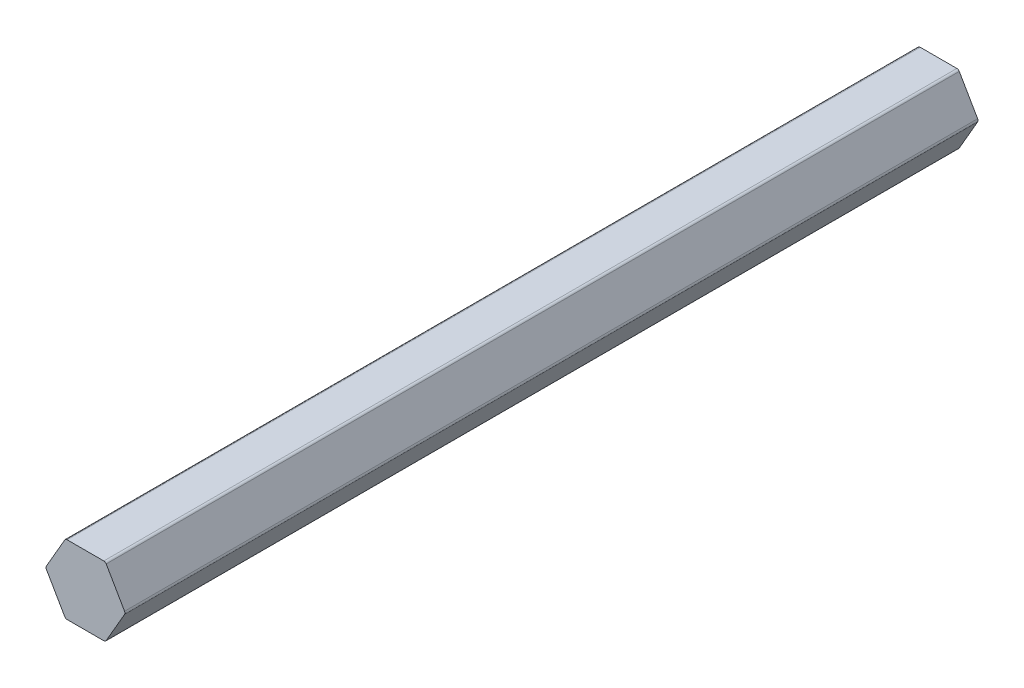
ISO-10303-21;
HEADER;
FILE_DESCRIPTION(('STEP AP214'),'2;1');
FILE_NAME('part.step','',(''),(''),'','','');
FILE_SCHEMA(('AUTOMOTIVE_DESIGN { 1 0 10303 214 1 1 1 1 }'));
ENDSEC;
DATA;
#1=APPLICATION_CONTEXT('core data for automotive mechanical design processes');
#2=APPLICATION_PROTOCOL_DEFINITION('international standard','automotive_design',2000,#1);
#3=PRODUCT_CONTEXT('',#1,'mechanical');
#4=PRODUCT('Part','Part','',(#3));
#5=PRODUCT_RELATED_PRODUCT_CATEGORY('part','',(#4));
#6=PRODUCT_DEFINITION_FORMATION('','',#4);
#7=PRODUCT_DEFINITION_CONTEXT('part definition',#1,'design');
#8=PRODUCT_DEFINITION('design','',#6,#7);
#9=PRODUCT_DEFINITION_SHAPE('','',#8);
#10=(LENGTH_UNIT() NAMED_UNIT(*) SI_UNIT(.MILLI.,.METRE.));
#11=(NAMED_UNIT(*) PLANE_ANGLE_UNIT() SI_UNIT($,.RADIAN.));
#12=(NAMED_UNIT(*) SI_UNIT($,.STERADIAN.) SOLID_ANGLE_UNIT());
#13=UNCERTAINTY_MEASURE_WITH_UNIT(LENGTH_MEASURE(1.E-05),#10,'distance_accuracy_value','');
#14=(GEOMETRIC_REPRESENTATION_CONTEXT(3) GLOBAL_UNCERTAINTY_ASSIGNED_CONTEXT((#13)) GLOBAL_UNIT_ASSIGNED_CONTEXT((#10,
#11,#12)) REPRESENTATION_CONTEXT('',''));
#15=CARTESIAN_POINT('',(0.,0.,0.));
#16=DIRECTION('',(0.,0.,1.));
#17=DIRECTION('',(1.,0.,0.));
#18=AXIS2_PLACEMENT_3D('',#15,#16,#17);
#19=CARTESIAN_POINT('',(-3.36554792418708,-5.8293,-72.136));
#20=DIRECTION('',(0.,0.,-1.));
#21=DIRECTION('',(-1.,0.,0.));
#22=AXIS2_PLACEMENT_3D('',#19,#20,#21);
#23=CYLINDRICAL_SURFACE('',#22,0.507999999999999);
#24=CARTESIAN_POINT('',(-3.36554792418708,-5.8293,-228.6));
#25=DIRECTION('',(0.,0.,-1.));
#26=DIRECTION('',(-1.,0.,0.));
#27=AXIS2_PLACEMENT_3D('',#24,#25,#26);
#28=CIRCLE('',#27,0.507999999999999);
#29=CARTESIAN_POINT('',(-3.36554792418708,-6.3373,-228.6));
#30=VERTEX_POINT('',#29);
#31=CARTESIAN_POINT('',(-3.80548882930957,-6.0833,-228.6));
#32=VERTEX_POINT('',#31);
#33=EDGE_CURVE('E153',#30,#32,#28,.T.);
#34=ORIENTED_EDGE('',*,*,#33,.F.);
#35=DIRECTION('',(0.,0.,-1.));
#36=VECTOR('',#35,1.);
#37=CARTESIAN_POINT('',(-3.36554792418708,-6.3373,-72.136));
#38=LINE('',#37,#36);
#39=CARTESIAN_POINT('',(-3.36554792418708,-6.3373,-72.136));
#40=VERTEX_POINT('',#39);
#41=EDGE_CURVE('E11',#40,#30,#38,.T.);
#42=ORIENTED_EDGE('',*,*,#41,.F.);
#43=CARTESIAN_POINT('',(-3.36554792418708,-5.8293,-72.136));
#44=DIRECTION('',(0.,0.,-1.));
#45=DIRECTION('',(-1.,0.,0.));
#46=AXIS2_PLACEMENT_3D('',#43,#44,#45);
#47=CIRCLE('',#46,0.507999999999999);
#48=CARTESIAN_POINT('',(-3.80548882930957,-6.0833,-72.136));
#49=VERTEX_POINT('',#48);
#50=EDGE_CURVE('E185',#40,#49,#47,.T.);
#51=ORIENTED_EDGE('',*,*,#50,.T.);
#52=DIRECTION('',(0.,0.,-1.));
#53=VECTOR('',#52,1.);
#54=CARTESIAN_POINT('',(-3.80548882930957,-6.0833,-72.136));
#55=LINE('',#54,#53);
#56=EDGE_CURVE('E35',#49,#32,#55,.T.);
#57=ORIENTED_EDGE('',*,*,#56,.T.);
#58=EDGE_LOOP('',(#34,#42,#51,#57));
#59=FACE_BOUND('',#58,.T.);
#60=ADVANCED_FACE('F32',(#59),#23,.T.);
#61=CARTESIAN_POINT('',(3.36554792418708,-6.3373,-72.136));
#62=DIRECTION('',(0.,-1.,0.));
#63=DIRECTION('',(1.,0.,0.));
#64=AXIS2_PLACEMENT_3D('',#61,#62,#63);
#65=PLANE('',#64);
#66=DIRECTION('',(-1.,0.,0.));
#67=VECTOR('',#66,1.);
#68=CARTESIAN_POINT('',(3.36554792418708,-6.3373,-228.6));
#69=LINE('',#68,#67);
#70=CARTESIAN_POINT('',(3.36554792418708,-6.3373,-228.6));
#71=VERTEX_POINT('',#70);
#72=EDGE_CURVE('E183',#71,#30,#69,.T.);
#73=ORIENTED_EDGE('',*,*,#72,.F.);
#74=DIRECTION('',(0.,0.,-1.));
#75=VECTOR('',#74,1.);
#76=CARTESIAN_POINT('',(3.36554792418708,-6.3373,-72.136));
#77=LINE('',#76,#75);
#78=CARTESIAN_POINT('',(3.36554792418708,-6.3373,-72.136));
#79=VERTEX_POINT('',#78);
#80=EDGE_CURVE('E41',#79,#71,#77,.T.);
#81=ORIENTED_EDGE('',*,*,#80,.F.);
#82=DIRECTION('',(-1.,0.,0.));
#83=VECTOR('',#82,1.);
#84=CARTESIAN_POINT('',(3.36554792418708,-6.3373,-72.136));
#85=LINE('',#84,#83);
#86=EDGE_CURVE('E143',#79,#40,#85,.T.);
#87=ORIENTED_EDGE('',*,*,#86,.T.);
#88=ORIENTED_EDGE('',*,*,#41,.T.);
#89=EDGE_LOOP('',(#73,#81,#87,#88));
#90=FACE_BOUND('',#89,.T.);
#91=ADVANCED_FACE('F205',(#90),#65,.T.);
#92=CARTESIAN_POINT('',(3.36554792418709,-5.8293,-72.136));
#93=DIRECTION('',(0.,0.,-1.));
#94=DIRECTION('',(-1.,0.,0.));
#95=AXIS2_PLACEMENT_3D('',#92,#93,#94);
#96=CYLINDRICAL_SURFACE('',#95,0.508);
#97=CARTESIAN_POINT('',(3.36554792418709,-5.8293,-228.6));
#98=DIRECTION('',(0.,0.,-1.));
#99=DIRECTION('',(-1.,0.,0.));
#100=AXIS2_PLACEMENT_3D('',#97,#98,#99);
#101=CIRCLE('',#100,0.508);
#102=CARTESIAN_POINT('',(3.80548882930958,-6.0833,-228.6));
#103=VERTEX_POINT('',#102);
#104=EDGE_CURVE('E130',#103,#71,#101,.T.);
#105=ORIENTED_EDGE('',*,*,#104,.F.);
#106=DIRECTION('',(0.,0.,-1.));
#107=VECTOR('',#106,1.);
#108=CARTESIAN_POINT('',(3.80548882930958,-6.0833,-72.136));
#109=LINE('',#108,#107);
#110=CARTESIAN_POINT('',(3.80548882930958,-6.0833,-72.136));
#111=VERTEX_POINT('',#110);
#112=EDGE_CURVE('E125',#111,#103,#109,.T.);
#113=ORIENTED_EDGE('',*,*,#112,.F.);
#114=CARTESIAN_POINT('',(3.36554792418709,-5.8293,-72.136));
#115=DIRECTION('',(0.,0.,-1.));
#116=DIRECTION('',(-1.,0.,0.));
#117=AXIS2_PLACEMENT_3D('',#114,#115,#116);
#118=CIRCLE('',#117,0.508);
#119=EDGE_CURVE('E128',#111,#79,#118,.T.);
#120=ORIENTED_EDGE('',*,*,#119,.T.);
#121=ORIENTED_EDGE('',*,*,#80,.T.);
#122=EDGE_LOOP('',(#105,#113,#120,#121));
#123=FACE_BOUND('',#122,.T.);
#124=ADVANCED_FACE('F127',(#123),#96,.T.);
#125=CARTESIAN_POINT('',(7.17103675349666,-0.253999999999997,-72.136));
#126=DIRECTION('',(0.866025403784439,-0.499999999999999,0.));
#127=DIRECTION('',(0.499999999999999,0.866025403784439,0.));
#128=AXIS2_PLACEMENT_3D('',#125,#126,#127);
#129=PLANE('',#128);
#130=DIRECTION('',(-0.499999999999999,-0.866025403784439,0.));
#131=VECTOR('',#130,1.);
#132=CARTESIAN_POINT('',(7.17103675349666,-0.253999999999997,-228.6));
#133=LINE('',#132,#131);
#134=CARTESIAN_POINT('',(7.17103675349666,-0.253999999999997,-228.6));
#135=VERTEX_POINT('',#134);
#136=EDGE_CURVE('E180',#135,#103,#133,.T.);
#137=ORIENTED_EDGE('',*,*,#136,.F.);
#138=DIRECTION('',(0.,0.,-1.));
#139=VECTOR('',#138,1.);
#140=CARTESIAN_POINT('',(7.17103675349666,-0.253999999999997,-72.136));
#141=LINE('',#140,#139);
#142=CARTESIAN_POINT('',(7.17103675349666,-0.253999999999997,-72.136));
#143=VERTEX_POINT('',#142);
#144=EDGE_CURVE('E135',#143,#135,#141,.T.);
#145=ORIENTED_EDGE('',*,*,#144,.F.);
#146=DIRECTION('',(-0.499999999999999,-0.866025403784439,0.));
#147=VECTOR('',#146,1.);
#148=CARTESIAN_POINT('',(7.17103675349666,-0.253999999999997,-72.136));
#149=LINE('',#148,#147);
#150=EDGE_CURVE('E141',#143,#111,#149,.T.);
#151=ORIENTED_EDGE('',*,*,#150,.T.);
#152=ORIENTED_EDGE('',*,*,#112,.T.);
#153=EDGE_LOOP('',(#137,#145,#151,#152));
#154=FACE_BOUND('',#153,.T.);
#155=ADVANCED_FACE('F145',(#154),#129,.T.);
#156=CARTESIAN_POINT('',(6.73109584837417,0.,-72.136));
#157=DIRECTION('',(0.,0.,-1.));
#158=DIRECTION('',(-1.,0.,0.));
#159=AXIS2_PLACEMENT_3D('',#156,#157,#158);
#160=CYLINDRICAL_SURFACE('',#159,0.507999999999999);
#161=CARTESIAN_POINT('',(6.73109584837417,0.,-228.6));
#162=DIRECTION('',(0.,0.,-1.));
#163=DIRECTION('',(-1.,0.,0.));
#164=AXIS2_PLACEMENT_3D('',#161,#162,#163);
#165=CIRCLE('',#164,0.507999999999999);
#166=CARTESIAN_POINT('',(7.17103675349666,0.254000000000003,-228.6));
#167=VERTEX_POINT('',#166);
#168=EDGE_CURVE('E177',#167,#135,#165,.T.);
#169=ORIENTED_EDGE('',*,*,#168,.F.);
#170=DIRECTION('',(0.,0.,-1.));
#171=VECTOR('',#170,1.);
#172=CARTESIAN_POINT('',(7.17103675349666,0.254000000000003,-72.136));
#173=LINE('',#172,#171);
#174=CARTESIAN_POINT('',(7.17103675349666,0.254000000000003,-72.136));
#175=VERTEX_POINT('',#174);
#176=EDGE_CURVE('E189',#175,#167,#173,.T.);
#177=ORIENTED_EDGE('',*,*,#176,.F.);
#178=CARTESIAN_POINT('',(6.73109584837417,0.,-72.136));
#179=DIRECTION('',(0.,0.,-1.));
#180=DIRECTION('',(-1.,0.,0.));
#181=AXIS2_PLACEMENT_3D('',#178,#179,#180);
#182=CIRCLE('',#181,0.507999999999999);
#183=EDGE_CURVE('E146',#175,#143,#182,.T.);
#184=ORIENTED_EDGE('',*,*,#183,.T.);
#185=ORIENTED_EDGE('',*,*,#144,.T.);
#186=EDGE_LOOP('',(#169,#177,#184,#185));
#187=FACE_BOUND('',#186,.T.);
#188=ADVANCED_FACE('F218',(#187),#160,.T.);
#189=CARTESIAN_POINT('',(3.80548882930958,6.0833,-72.136));
#190=DIRECTION('',(0.866025403784439,0.5,0.));
#191=DIRECTION('',(-0.5,0.866025403784439,0.));
#192=AXIS2_PLACEMENT_3D('',#189,#190,#191);
#193=PLANE('',#192);
#194=DIRECTION('',(0.5,-0.866025403784439,0.));
#195=VECTOR('',#194,1.);
#196=CARTESIAN_POINT('',(3.80548882930958,6.0833,-228.6));
#197=LINE('',#196,#195);
#198=CARTESIAN_POINT('',(3.80548882930958,6.0833,-228.6));
#199=VERTEX_POINT('',#198);
#200=EDGE_CURVE('E174',#199,#167,#197,.T.);
#201=ORIENTED_EDGE('',*,*,#200,.F.);
#202=DIRECTION('',(0.,0.,-1.));
#203=VECTOR('',#202,1.);
#204=CARTESIAN_POINT('',(3.80548882930958,6.0833,-72.136));
#205=LINE('',#204,#203);
#206=CARTESIAN_POINT('',(3.80548882930958,6.0833,-72.136));
#207=VERTEX_POINT('',#206);
#208=EDGE_CURVE('E191',#207,#199,#205,.T.);
#209=ORIENTED_EDGE('',*,*,#208,.F.);
#210=DIRECTION('',(0.5,-0.866025403784439,0.));
#211=VECTOR('',#210,1.);
#212=CARTESIAN_POINT('',(3.80548882930958,6.0833,-72.136));
#213=LINE('',#212,#211);
#214=EDGE_CURVE('E148',#207,#175,#213,.T.);
#215=ORIENTED_EDGE('',*,*,#214,.T.);
#216=ORIENTED_EDGE('',*,*,#176,.T.);
#217=EDGE_LOOP('',(#201,#209,#215,#216));
#218=FACE_BOUND('',#217,.T.);
#219=ADVANCED_FACE('F221',(#218),#193,.T.);
#220=CARTESIAN_POINT('',(3.36554792418708,5.8293,-72.136));
#221=DIRECTION('',(0.,0.,-1.));
#222=DIRECTION('',(-1.,0.,0.));
#223=AXIS2_PLACEMENT_3D('',#220,#221,#222);
#224=CYLINDRICAL_SURFACE('',#223,0.508);
#225=CARTESIAN_POINT('',(3.36554792418708,5.8293,-228.6));
#226=DIRECTION('',(0.,0.,-1.));
#227=DIRECTION('',(-1.,0.,0.));
#228=AXIS2_PLACEMENT_3D('',#225,#226,#227);
#229=CIRCLE('',#228,0.508);
#230=CARTESIAN_POINT('',(3.36554792418708,6.3373,-228.6));
#231=VERTEX_POINT('',#230);
#232=EDGE_CURVE('E171',#231,#199,#229,.T.);
#233=ORIENTED_EDGE('',*,*,#232,.F.);
#234=DIRECTION('',(0.,0.,-1.));
#235=VECTOR('',#234,1.);
#236=CARTESIAN_POINT('',(3.36554792418708,6.3373,-72.136));
#237=LINE('',#236,#235);
#238=CARTESIAN_POINT('',(3.36554792418708,6.3373,-72.136));
#239=VERTEX_POINT('',#238);
#240=EDGE_CURVE('E193',#239,#231,#237,.T.);
#241=ORIENTED_EDGE('',*,*,#240,.F.);
#242=CARTESIAN_POINT('',(3.36554792418708,5.8293,-72.136));
#243=DIRECTION('',(0.,0.,-1.));
#244=DIRECTION('',(-1.,0.,0.));
#245=AXIS2_PLACEMENT_3D('',#242,#243,#244);
#246=CIRCLE('',#245,0.508);
#247=EDGE_CURVE('E347',#239,#207,#246,.T.);
#248=ORIENTED_EDGE('',*,*,#247,.T.);
#249=ORIENTED_EDGE('',*,*,#208,.T.);
#250=EDGE_LOOP('',(#233,#241,#248,#249));
#251=FACE_BOUND('',#250,.T.);
#252=ADVANCED_FACE('F225',(#251),#224,.T.);
#253=CARTESIAN_POINT('',(-3.36554792418708,6.3373,-72.136));
#254=DIRECTION('',(0.,1.,0.));
#255=DIRECTION('',(-1.,0.,0.));
#256=AXIS2_PLACEMENT_3D('',#253,#254,#255);
#257=PLANE('',#256);
#258=DIRECTION('',(1.,0.,0.));
#259=VECTOR('',#258,1.);
#260=CARTESIAN_POINT('',(-3.36554792418708,6.3373,-228.6));
#261=LINE('',#260,#259);
#262=CARTESIAN_POINT('',(-3.36554792418708,6.3373,-228.6));
#263=VERTEX_POINT('',#262);
#264=EDGE_CURVE('E168',#263,#231,#261,.T.);
#265=ORIENTED_EDGE('',*,*,#264,.F.);
#266=DIRECTION('',(0.,0.,-1.));
#267=VECTOR('',#266,1.);
#268=CARTESIAN_POINT('',(-3.36554792418708,6.3373,-72.136));
#269=LINE('',#268,#267);
#270=CARTESIAN_POINT('',(-3.36554792418708,6.3373,-72.136));
#271=VERTEX_POINT('',#270);
#272=EDGE_CURVE('E195',#271,#263,#269,.T.);
#273=ORIENTED_EDGE('',*,*,#272,.F.);
#274=DIRECTION('',(1.,0.,0.));
#275=VECTOR('',#274,1.);
#276=CARTESIAN_POINT('',(-3.36554792418708,6.3373,-72.136));
#277=LINE('',#276,#275);
#278=EDGE_CURVE('E351',#271,#239,#277,.T.);
#279=ORIENTED_EDGE('',*,*,#278,.T.);
#280=ORIENTED_EDGE('',*,*,#240,.T.);
#281=EDGE_LOOP('',(#265,#273,#279,#280));
#282=FACE_BOUND('',#281,.T.);
#283=ADVANCED_FACE('F229',(#282),#257,.T.);
#284=CARTESIAN_POINT('',(-3.36554792418708,5.8293,-72.136));
#285=DIRECTION('',(0.,0.,-1.));
#286=DIRECTION('',(-1.,0.,0.));
#287=AXIS2_PLACEMENT_3D('',#284,#285,#286);
#288=CYLINDRICAL_SURFACE('',#287,0.508);
#289=CARTESIAN_POINT('',(-3.36554792418708,5.8293,-228.6));
#290=DIRECTION('',(0.,0.,-1.));
#291=DIRECTION('',(-1.,0.,0.));
#292=AXIS2_PLACEMENT_3D('',#289,#290,#291);
#293=CIRCLE('',#292,0.508);
#294=CARTESIAN_POINT('',(-3.80548882930958,6.0833,-228.6));
#295=VERTEX_POINT('',#294);
#296=EDGE_CURVE('E165',#295,#263,#293,.T.);
#297=ORIENTED_EDGE('',*,*,#296,.F.);
#298=DIRECTION('',(0.,0.,-1.));
#299=VECTOR('',#298,1.);
#300=CARTESIAN_POINT('',(-3.80548882930958,6.0833,-72.136));
#301=LINE('',#300,#299);
#302=CARTESIAN_POINT('',(-3.80548882930958,6.0833,-72.136));
#303=VERTEX_POINT('',#302);
#304=EDGE_CURVE('E197',#303,#295,#301,.T.);
#305=ORIENTED_EDGE('',*,*,#304,.F.);
#306=CARTESIAN_POINT('',(-3.36554792418708,5.8293,-72.136));
#307=DIRECTION('',(0.,0.,-1.));
#308=DIRECTION('',(-1.,0.,0.));
#309=AXIS2_PLACEMENT_3D('',#306,#307,#308);
#310=CIRCLE('',#309,0.508);
#311=EDGE_CURVE('E340',#303,#271,#310,.T.);
#312=ORIENTED_EDGE('',*,*,#311,.T.);
#313=ORIENTED_EDGE('',*,*,#272,.T.);
#314=EDGE_LOOP('',(#297,#305,#312,#313));
#315=FACE_BOUND('',#314,.T.);
#316=ADVANCED_FACE('F233',(#315),#288,.T.);
#317=CARTESIAN_POINT('',(-7.17103675349666,0.253999999999996,-72.136));
#318=DIRECTION('',(-0.866025403784439,0.5,0.));
#319=DIRECTION('',(-0.5,-0.866025403784439,0.));
#320=AXIS2_PLACEMENT_3D('',#317,#318,#319);
#321=PLANE('',#320);
#322=DIRECTION('',(0.5,0.866025403784439,0.));
#323=VECTOR('',#322,1.);
#324=CARTESIAN_POINT('',(-7.17103675349666,0.253999999999996,-228.6));
#325=LINE('',#324,#323);
#326=CARTESIAN_POINT('',(-7.17103675349666,0.253999999999996,-228.6));
#327=VERTEX_POINT('',#326);
#328=EDGE_CURVE('E162',#327,#295,#325,.T.);
#329=ORIENTED_EDGE('',*,*,#328,.F.);
#330=DIRECTION('',(0.,0.,-1.));
#331=VECTOR('',#330,1.);
#332=CARTESIAN_POINT('',(-7.17103675349666,0.253999999999996,-72.136));
#333=LINE('',#332,#331);
#334=CARTESIAN_POINT('',(-7.17103675349666,0.253999999999996,-72.136));
#335=VERTEX_POINT('',#334);
#336=EDGE_CURVE('E199',#335,#327,#333,.T.);
#337=ORIENTED_EDGE('',*,*,#336,.F.);
#338=DIRECTION('',(0.5,0.866025403784439,0.));
#339=VECTOR('',#338,1.);
#340=CARTESIAN_POINT('',(-7.17103675349666,0.253999999999996,-72.136));
#341=LINE('',#340,#339);
#342=EDGE_CURVE('E336',#335,#303,#341,.T.);
#343=ORIENTED_EDGE('',*,*,#342,.T.);
#344=ORIENTED_EDGE('',*,*,#304,.T.);
#345=EDGE_LOOP('',(#329,#337,#343,#344));
#346=FACE_BOUND('',#345,.T.);
#347=ADVANCED_FACE('F237',(#346),#321,.T.);
#348=CARTESIAN_POINT('',(-6.73109584837417,0.,-72.136));
#349=DIRECTION('',(0.,0.,-1.));
#350=DIRECTION('',(-1.,0.,0.));
#351=AXIS2_PLACEMENT_3D('',#348,#349,#350);
#352=CYLINDRICAL_SURFACE('',#351,0.508000000000001);
#353=CARTESIAN_POINT('',(-6.73109584837417,0.,-228.6));
#354=DIRECTION('',(0.,0.,-1.));
#355=DIRECTION('',(-1.,0.,0.));
#356=AXIS2_PLACEMENT_3D('',#353,#354,#355);
#357=CIRCLE('',#356,0.508000000000001);
#358=CARTESIAN_POINT('',(-7.17103675349666,-0.254000000000005,-228.6));
#359=VERTEX_POINT('',#358);
#360=EDGE_CURVE('E159',#359,#327,#357,.T.);
#361=ORIENTED_EDGE('',*,*,#360,.F.);
#362=DIRECTION('',(0.,0.,-1.));
#363=VECTOR('',#362,1.);
#364=CARTESIAN_POINT('',(-7.17103675349666,-0.254000000000005,-72.136));
#365=LINE('',#364,#363);
#366=CARTESIAN_POINT('',(-7.17103675349666,-0.254000000000005,-72.136));
#367=VERTEX_POINT('',#366);
#368=EDGE_CURVE('E200',#367,#359,#365,.T.);
#369=ORIENTED_EDGE('',*,*,#368,.F.);
#370=CARTESIAN_POINT('',(-6.73109584837417,0.,-72.136));
#371=DIRECTION('',(0.,0.,-1.));
#372=DIRECTION('',(-1.,0.,0.));
#373=AXIS2_PLACEMENT_3D('',#370,#371,#372);
#374=CIRCLE('',#373,0.508000000000001);
#375=EDGE_CURVE('E357',#367,#335,#374,.T.);
#376=ORIENTED_EDGE('',*,*,#375,.T.);
#377=ORIENTED_EDGE('',*,*,#336,.T.);
#378=EDGE_LOOP('',(#361,#369,#376,#377));
#379=FACE_BOUND('',#378,.T.);
#380=ADVANCED_FACE('F241',(#379),#352,.T.);
#381=CARTESIAN_POINT('',(-3.80548882930957,-6.0833,-72.136));
#382=DIRECTION('',(-0.866025403784438,-0.5,0.));
#383=DIRECTION('',(0.5,-0.866025403784438,0.));
#384=AXIS2_PLACEMENT_3D('',#381,#382,#383);
#385=PLANE('',#384);
#386=DIRECTION('',(-0.500000000000001,0.866025403784438,0.));
#387=VECTOR('',#386,1.);
#388=CARTESIAN_POINT('',(-3.80548882930957,-6.0833,-228.6));
#389=LINE('',#388,#387);
#390=EDGE_CURVE('E156',#32,#359,#389,.T.);
#391=ORIENTED_EDGE('',*,*,#390,.F.);
#392=ORIENTED_EDGE('',*,*,#56,.F.);
#393=DIRECTION('',(-0.500000000000001,0.866025403784438,0.));
#394=VECTOR('',#393,1.);
#395=CARTESIAN_POINT('',(-3.80548882930957,-6.0833,-72.136));
#396=LINE('',#395,#394);
#397=EDGE_CURVE('E359',#49,#367,#396,.T.);
#398=ORIENTED_EDGE('',*,*,#397,.T.);
#399=ORIENTED_EDGE('',*,*,#368,.T.);
#400=EDGE_LOOP('',(#391,#392,#398,#399));
#401=FACE_BOUND('',#400,.T.);
#402=ADVANCED_FACE('F202',(#401),#385,.T.);
#403=CARTESIAN_POINT('',(-3.36554792418708,-5.8293,-72.136));
#404=DIRECTION('',(0.,0.,-1.));
#405=DIRECTION('',(-1.,0.,0.));
#406=AXIS2_PLACEMENT_3D('',#403,#404,#405);
#407=PLANE('',#406);
#408=ORIENTED_EDGE('',*,*,#50,.F.);
#409=ORIENTED_EDGE('',*,*,#86,.F.);
#410=ORIENTED_EDGE('',*,*,#119,.F.);
#411=ORIENTED_EDGE('',*,*,#150,.F.);
#412=ORIENTED_EDGE('',*,*,#183,.F.);
#413=ORIENTED_EDGE('',*,*,#214,.F.);
#414=ORIENTED_EDGE('',*,*,#247,.F.);
#415=ORIENTED_EDGE('',*,*,#278,.F.);
#416=ORIENTED_EDGE('',*,*,#311,.F.);
#417=ORIENTED_EDGE('',*,*,#342,.F.);
#418=ORIENTED_EDGE('',*,*,#375,.F.);
#419=ORIENTED_EDGE('',*,*,#397,.F.);
#420=EDGE_LOOP('',(#408,#409,#410,#411,#412,#413,#414,#415,#416,#417,#418,#419));
#421=FACE_BOUND('',#420,.T.);
#422=ADVANCED_FACE('F139',(#421),#407,.F.);
#423=CARTESIAN_POINT('',(-3.36554792418708,-5.8293,-228.6));
#424=DIRECTION('',(0.,0.,-1.));
#425=DIRECTION('',(-1.,0.,0.));
#426=AXIS2_PLACEMENT_3D('',#423,#424,#425);
#427=PLANE('',#426);
#428=ORIENTED_EDGE('',*,*,#33,.T.);
#429=ORIENTED_EDGE('',*,*,#390,.T.);
#430=ORIENTED_EDGE('',*,*,#360,.T.);
#431=ORIENTED_EDGE('',*,*,#328,.T.);
#432=ORIENTED_EDGE('',*,*,#296,.T.);
#433=ORIENTED_EDGE('',*,*,#264,.T.);
#434=ORIENTED_EDGE('',*,*,#232,.T.);
#435=ORIENTED_EDGE('',*,*,#200,.T.);
#436=ORIENTED_EDGE('',*,*,#168,.T.);
#437=ORIENTED_EDGE('',*,*,#136,.T.);
#438=ORIENTED_EDGE('',*,*,#104,.T.);
#439=ORIENTED_EDGE('',*,*,#72,.T.);
#440=EDGE_LOOP('',(#428,#429,#430,#431,#432,#433,#434,#435,#436,#437,#438,#439));
#441=FACE_BOUND('',#440,.T.);
#442=ADVANCED_FACE('F204',(#441),#427,.T.);
#443=CLOSED_SHELL('',(#60,#91,#124,#155,#188,#219,#252,#283,#316,#347,#380,#402,#422,#442));
#444=MANIFOLD_SOLID_BREP('B2',#443);
#445=ADVANCED_BREP_SHAPE_REPRESENTATION('',(#18,#444),#14);
#446=SHAPE_DEFINITION_REPRESENTATION(#9,#445);
ENDSEC;
END-ISO-10303-21;
